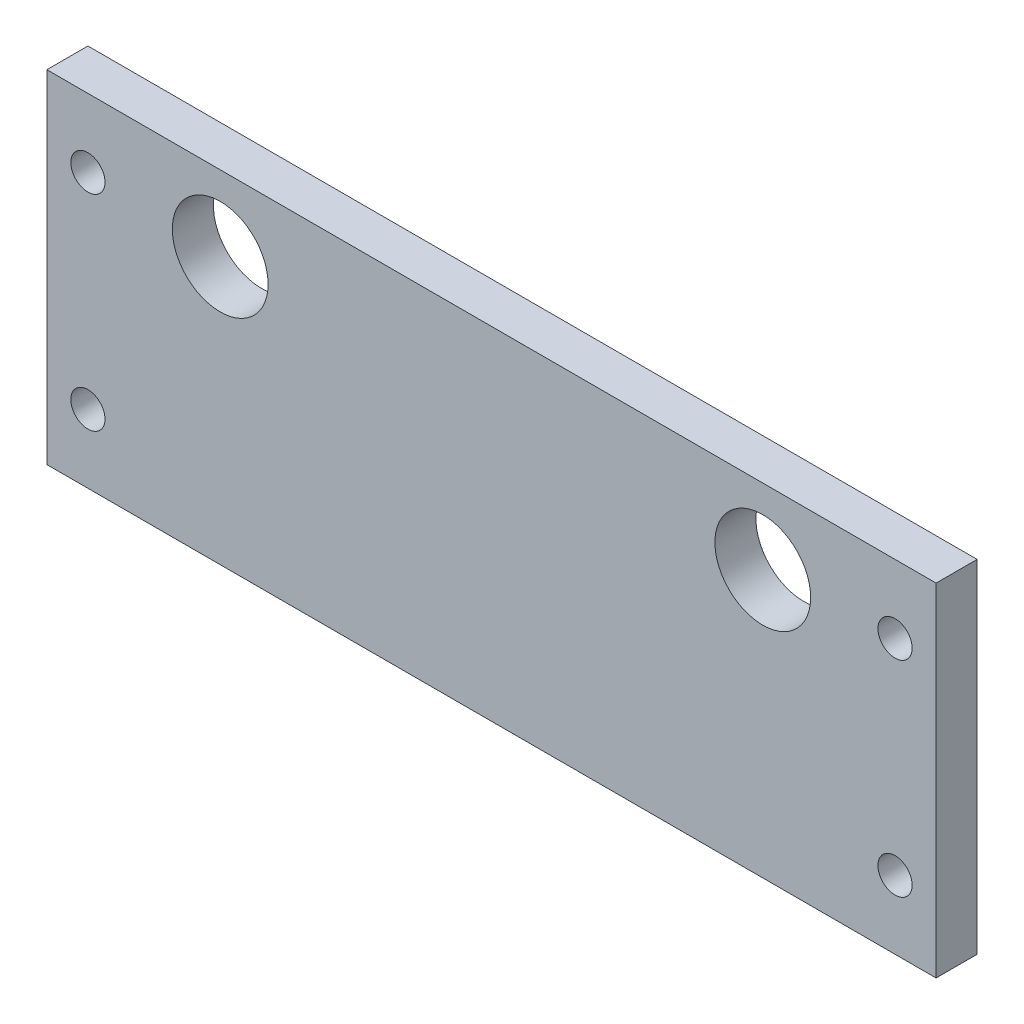
ISO-10303-21;
HEADER;
FILE_DESCRIPTION(('STEP AP214'),'2;1');
FILE_NAME('part.step','',(''),(''),'','','');
FILE_SCHEMA(('AUTOMOTIVE_DESIGN { 1 0 10303 214 1 1 1 1 }'));
ENDSEC;
DATA;
#1=APPLICATION_CONTEXT('core data for automotive mechanical design processes');
#2=APPLICATION_PROTOCOL_DEFINITION('international standard','automotive_design',2000,#1);
#3=PRODUCT_CONTEXT('',#1,'mechanical');
#4=PRODUCT('Part','Part','',(#3));
#5=PRODUCT_RELATED_PRODUCT_CATEGORY('part','',(#4));
#6=PRODUCT_DEFINITION_FORMATION('','',#4);
#7=PRODUCT_DEFINITION_CONTEXT('part definition',#1,'design');
#8=PRODUCT_DEFINITION('design','',#6,#7);
#9=PRODUCT_DEFINITION_SHAPE('','',#8);
#10=(LENGTH_UNIT() NAMED_UNIT(*) SI_UNIT(.MILLI.,.METRE.));
#11=(NAMED_UNIT(*) PLANE_ANGLE_UNIT() SI_UNIT($,.RADIAN.));
#12=(NAMED_UNIT(*) SI_UNIT($,.STERADIAN.) SOLID_ANGLE_UNIT());
#13=UNCERTAINTY_MEASURE_WITH_UNIT(LENGTH_MEASURE(1.E-05),#10,'distance_accuracy_value','');
#14=(GEOMETRIC_REPRESENTATION_CONTEXT(3) GLOBAL_UNCERTAINTY_ASSIGNED_CONTEXT((#13)) GLOBAL_UNIT_ASSIGNED_CONTEXT((#10,
#11,#12)) REPRESENTATION_CONTEXT('',''));
#15=CARTESIAN_POINT('',(0.,0.,0.));
#16=DIRECTION('',(0.,0.,1.));
#17=DIRECTION('',(1.,0.,0.));
#18=AXIS2_PLACEMENT_3D('',#15,#16,#17);
#19=CARTESIAN_POINT('',(32.5,0.,3.));
#20=DIRECTION('',(1.,0.,0.));
#21=DIRECTION('',(0.,0.,-1.));
#22=AXIS2_PLACEMENT_3D('',#19,#20,#21);
#23=PLANE('',#22);
#24=DIRECTION('',(0.,-1.,0.));
#25=VECTOR('',#24,1.);
#26=CARTESIAN_POINT('',(32.5,0.,0.));
#27=LINE('',#26,#25);
#28=CARTESIAN_POINT('',(32.5,12.5,0.));
#29=VERTEX_POINT('',#28);
#30=CARTESIAN_POINT('',(32.5,-12.5,0.));
#31=VERTEX_POINT('',#30);
#32=EDGE_CURVE('E114',#29,#31,#27,.T.);
#33=ORIENTED_EDGE('',*,*,#32,.F.);
#34=DIRECTION('',(0.,0.,-1.));
#35=VECTOR('',#34,1.);
#36=CARTESIAN_POINT('',(32.5,12.5,3.));
#37=LINE('',#36,#35);
#38=CARTESIAN_POINT('',(32.5,12.5,3.));
#39=VERTEX_POINT('',#38);
#40=EDGE_CURVE('E11',#39,#29,#37,.T.);
#41=ORIENTED_EDGE('',*,*,#40,.F.);
#42=DIRECTION('',(0.,-1.,0.));
#43=VECTOR('',#42,1.);
#44=CARTESIAN_POINT('',(32.5,0.,3.));
#45=LINE('',#44,#43);
#46=CARTESIAN_POINT('',(32.5,-12.5,3.));
#47=VERTEX_POINT('',#46);
#48=EDGE_CURVE('E100',#39,#47,#45,.T.);
#49=ORIENTED_EDGE('',*,*,#48,.T.);
#50=DIRECTION('',(0.,0.,-1.));
#51=VECTOR('',#50,1.);
#52=CARTESIAN_POINT('',(32.5,-12.5,3.));
#53=LINE('',#52,#51);
#54=EDGE_CURVE('E78',#47,#31,#53,.T.);
#55=ORIENTED_EDGE('',*,*,#54,.T.);
#56=EDGE_LOOP('',(#33,#41,#49,#55));
#57=FACE_BOUND('',#56,.T.);
#58=ADVANCED_FACE('F37',(#57),#23,.T.);
#59=CARTESIAN_POINT('',(0.,12.5,3.));
#60=DIRECTION('',(0.,1.,0.));
#61=DIRECTION('',(0.,0.,1.));
#62=AXIS2_PLACEMENT_3D('',#59,#60,#61);
#63=PLANE('',#62);
#64=DIRECTION('',(1.,0.,0.));
#65=VECTOR('',#64,1.);
#66=CARTESIAN_POINT('',(0.,12.5,0.));
#67=LINE('',#66,#65);
#68=CARTESIAN_POINT('',(-32.5,12.5,0.));
#69=VERTEX_POINT('',#68);
#70=EDGE_CURVE('E90',#69,#29,#67,.T.);
#71=ORIENTED_EDGE('',*,*,#70,.F.);
#72=DIRECTION('',(0.,0.,-1.));
#73=VECTOR('',#72,1.);
#74=CARTESIAN_POINT('',(-32.5,12.5,3.));
#75=LINE('',#74,#73);
#76=CARTESIAN_POINT('',(-32.5,12.5,3.));
#77=VERTEX_POINT('',#76);
#78=EDGE_CURVE('E47',#77,#69,#75,.T.);
#79=ORIENTED_EDGE('',*,*,#78,.F.);
#80=DIRECTION('',(1.,0.,0.));
#81=VECTOR('',#80,1.);
#82=CARTESIAN_POINT('',(0.,12.5,3.));
#83=LINE('',#82,#81);
#84=EDGE_CURVE('E88',#77,#39,#83,.T.);
#85=ORIENTED_EDGE('',*,*,#84,.T.);
#86=ORIENTED_EDGE('',*,*,#40,.T.);
#87=EDGE_LOOP('',(#71,#79,#85,#86));
#88=FACE_BOUND('',#87,.T.);
#89=ADVANCED_FACE('F86',(#88),#63,.T.);
#90=CARTESIAN_POINT('',(-32.5,0.,3.));
#91=DIRECTION('',(1.,0.,0.));
#92=DIRECTION('',(0.,0.,-1.));
#93=AXIS2_PLACEMENT_3D('',#90,#91,#92);
#94=PLANE('',#93);
#95=DIRECTION('',(0.,-1.,0.));
#96=VECTOR('',#95,1.);
#97=CARTESIAN_POINT('',(-32.5,0.,0.));
#98=LINE('',#97,#96);
#99=CARTESIAN_POINT('',(-32.5,-12.5,0.));
#100=VERTEX_POINT('',#99);
#101=EDGE_CURVE('E117',#69,#100,#98,.T.);
#102=ORIENTED_EDGE('',*,*,#101,.T.);
#103=DIRECTION('',(0.,0.,-1.));
#104=VECTOR('',#103,1.);
#105=CARTESIAN_POINT('',(-32.5,-12.5,3.));
#106=LINE('',#105,#104);
#107=CARTESIAN_POINT('',(-32.5,-12.5,3.));
#108=VERTEX_POINT('',#107);
#109=EDGE_CURVE('E93',#108,#100,#106,.T.);
#110=ORIENTED_EDGE('',*,*,#109,.F.);
#111=DIRECTION('',(0.,-1.,0.));
#112=VECTOR('',#111,1.);
#113=CARTESIAN_POINT('',(-32.5,0.,3.));
#114=LINE('',#113,#112);
#115=EDGE_CURVE('E96',#77,#108,#114,.T.);
#116=ORIENTED_EDGE('',*,*,#115,.F.);
#117=ORIENTED_EDGE('',*,*,#78,.T.);
#118=EDGE_LOOP('',(#102,#110,#116,#117));
#119=FACE_BOUND('',#118,.T.);
#120=ADVANCED_FACE('F97',(#119),#94,.F.);
#121=CARTESIAN_POINT('',(-19.83,7.,3.));
#122=DIRECTION('',(0.,0.,-1.));
#123=DIRECTION('',(-1.,0.,0.));
#124=AXIS2_PLACEMENT_3D('',#121,#122,#123);
#125=CYLINDRICAL_SURFACE('',#124,3.50000000000002);
#126=CARTESIAN_POINT('',(-19.83,7.,3.));
#127=DIRECTION('',(0.,0.,1.));
#128=DIRECTION('',(1.,0.,0.));
#129=AXIS2_PLACEMENT_3D('',#126,#127,#128);
#130=CIRCLE('',#129,3.50000000000002);
#131=CARTESIAN_POINT('',(-16.33,7.,3.));
#132=VERTEX_POINT('',#131);
#133=EDGE_CURVE('E102',#132,#132,#130,.T.);
#134=ORIENTED_EDGE('',*,*,#133,.T.);
#135=EDGE_LOOP('',(#134));
#136=FACE_BOUND('',#135,.T.);
#137=CARTESIAN_POINT('',(-19.83,7.,0.));
#138=DIRECTION('',(0.,0.,1.));
#139=DIRECTION('',(1.,0.,0.));
#140=AXIS2_PLACEMENT_3D('',#137,#138,#139);
#141=CIRCLE('',#140,3.50000000000002);
#142=CARTESIAN_POINT('',(-16.33,7.,0.));
#143=VERTEX_POINT('',#142);
#144=EDGE_CURVE('E110',#143,#143,#141,.T.);
#145=ORIENTED_EDGE('',*,*,#144,.F.);
#146=EDGE_LOOP('',(#145));
#147=FACE_BOUND('',#146,.T.);
#148=ADVANCED_FACE('F132',(#136,#147),#125,.F.);
#149=CARTESIAN_POINT('',(19.83,7.,3.));
#150=DIRECTION('',(0.,0.,-1.));
#151=DIRECTION('',(-1.,0.,0.));
#152=AXIS2_PLACEMENT_3D('',#149,#150,#151);
#153=CYLINDRICAL_SURFACE('',#152,3.50000000000002);
#154=CARTESIAN_POINT('',(19.83,7.,3.));
#155=DIRECTION('',(0.,0.,1.));
#156=DIRECTION('',(1.,0.,0.));
#157=AXIS2_PLACEMENT_3D('',#154,#155,#156);
#158=CIRCLE('',#157,3.50000000000002);
#159=CARTESIAN_POINT('',(23.33,7.,3.));
#160=VERTEX_POINT('',#159);
#161=EDGE_CURVE('E120',#160,#160,#158,.T.);
#162=ORIENTED_EDGE('',*,*,#161,.T.);
#163=EDGE_LOOP('',(#162));
#164=FACE_BOUND('',#163,.T.);
#165=CARTESIAN_POINT('',(19.83,7.,0.));
#166=DIRECTION('',(0.,0.,1.));
#167=DIRECTION('',(1.,0.,0.));
#168=AXIS2_PLACEMENT_3D('',#165,#166,#167);
#169=CIRCLE('',#168,3.50000000000002);
#170=CARTESIAN_POINT('',(23.33,7.,0.));
#171=VERTEX_POINT('',#170);
#172=EDGE_CURVE('E107',#171,#171,#169,.T.);
#173=ORIENTED_EDGE('',*,*,#172,.F.);
#174=EDGE_LOOP('',(#173));
#175=FACE_BOUND('',#174,.T.);
#176=ADVANCED_FACE('F39',(#164,#175),#153,.F.);
#177=CARTESIAN_POINT('',(0.,-12.5,3.));
#178=DIRECTION('',(0.,1.,0.));
#179=DIRECTION('',(-1.,0.,0.));
#180=AXIS2_PLACEMENT_3D('',#177,#178,#179);
#181=PLANE('',#180);
#182=DIRECTION('',(1.,0.,0.));
#183=VECTOR('',#182,1.);
#184=CARTESIAN_POINT('',(0.,-12.5,0.));
#185=LINE('',#184,#183);
#186=EDGE_CURVE('E71',#100,#31,#185,.T.);
#187=ORIENTED_EDGE('',*,*,#186,.T.);
#188=ORIENTED_EDGE('',*,*,#54,.F.);
#189=DIRECTION('',(1.,0.,0.));
#190=VECTOR('',#189,1.);
#191=CARTESIAN_POINT('',(0.,-12.5,3.));
#192=LINE('',#191,#190);
#193=EDGE_CURVE('E55',#108,#47,#192,.T.);
#194=ORIENTED_EDGE('',*,*,#193,.F.);
#195=ORIENTED_EDGE('',*,*,#109,.T.);
#196=EDGE_LOOP('',(#187,#188,#194,#195));
#197=FACE_BOUND('',#196,.T.);
#198=ADVANCED_FACE('F123',(#197),#181,.F.);
#199=CARTESIAN_POINT('',(0.,0.,3.));
#200=DIRECTION('',(0.,0.,1.));
#201=DIRECTION('',(1.,0.,0.));
#202=AXIS2_PLACEMENT_3D('',#199,#200,#201);
#203=PLANE('',#202);
#204=CARTESIAN_POINT('',(-29.5,7.5,3.));
#205=DIRECTION('',(0.,0.,1.));
#206=DIRECTION('',(1.,0.,0.));
#207=AXIS2_PLACEMENT_3D('',#204,#205,#206);
#208=CIRCLE('',#207,1.25);
#209=CARTESIAN_POINT('',(-28.25,7.5,3.));
#210=VERTEX_POINT('',#209);
#211=EDGE_CURVE('E224',#210,#210,#208,.T.);
#212=ORIENTED_EDGE('',*,*,#211,.F.);
#213=EDGE_LOOP('',(#212));
#214=FACE_BOUND('',#213,.T.);
#215=CARTESIAN_POINT('',(-29.5,-7.5,3.));
#216=DIRECTION('',(0.,0.,1.));
#217=DIRECTION('',(1.,0.,0.));
#218=AXIS2_PLACEMENT_3D('',#215,#216,#217);
#219=CIRCLE('',#218,1.25);
#220=CARTESIAN_POINT('',(-28.25,-7.5,3.));
#221=VERTEX_POINT('',#220);
#222=EDGE_CURVE('E227',#221,#221,#219,.T.);
#223=ORIENTED_EDGE('',*,*,#222,.F.);
#224=EDGE_LOOP('',(#223));
#225=FACE_BOUND('',#224,.T.);
#226=CARTESIAN_POINT('',(29.5,7.5,3.));
#227=DIRECTION('',(0.,0.,1.));
#228=DIRECTION('',(1.,0.,0.));
#229=AXIS2_PLACEMENT_3D('',#226,#227,#228);
#230=CIRCLE('',#229,1.25);
#231=CARTESIAN_POINT('',(30.75,7.5,3.));
#232=VERTEX_POINT('',#231);
#233=EDGE_CURVE('E233',#232,#232,#230,.T.);
#234=ORIENTED_EDGE('',*,*,#233,.F.);
#235=EDGE_LOOP('',(#234));
#236=FACE_BOUND('',#235,.T.);
#237=CARTESIAN_POINT('',(29.5,-7.5,3.));
#238=DIRECTION('',(0.,0.,1.));
#239=DIRECTION('',(1.,0.,0.));
#240=AXIS2_PLACEMENT_3D('',#237,#238,#239);
#241=CIRCLE('',#240,1.25);
#242=CARTESIAN_POINT('',(30.75,-7.5,3.));
#243=VERTEX_POINT('',#242);
#244=EDGE_CURVE('E239',#243,#243,#241,.T.);
#245=ORIENTED_EDGE('',*,*,#244,.F.);
#246=EDGE_LOOP('',(#245));
#247=FACE_BOUND('',#246,.T.);
#248=ORIENTED_EDGE('',*,*,#161,.F.);
#249=EDGE_LOOP('',(#248));
#250=FACE_BOUND('',#249,.T.);
#251=ORIENTED_EDGE('',*,*,#133,.F.);
#252=EDGE_LOOP('',(#251));
#253=FACE_BOUND('',#252,.T.);
#254=ORIENTED_EDGE('',*,*,#48,.F.);
#255=ORIENTED_EDGE('',*,*,#84,.F.);
#256=ORIENTED_EDGE('',*,*,#115,.T.);
#257=ORIENTED_EDGE('',*,*,#193,.T.);
#258=EDGE_LOOP('',(#254,#255,#256,#257));
#259=FACE_BOUND('',#258,.T.);
#260=ADVANCED_FACE('F99',(#214,#225,#236,#247,#250,#253,#259),#203,.T.);
#261=CARTESIAN_POINT('',(0.,0.,0.));
#262=DIRECTION('',(0.,0.,1.));
#263=DIRECTION('',(1.,0.,0.));
#264=AXIS2_PLACEMENT_3D('',#261,#262,#263);
#265=PLANE('',#264);
#266=CARTESIAN_POINT('',(-29.5,7.5,0.));
#267=DIRECTION('',(0.,0.,1.));
#268=DIRECTION('',(1.,0.,0.));
#269=AXIS2_PLACEMENT_3D('',#266,#267,#268);
#270=CIRCLE('',#269,1.25);
#271=CARTESIAN_POINT('',(-28.25,7.5,0.));
#272=VERTEX_POINT('',#271);
#273=EDGE_CURVE('E226',#272,#272,#270,.T.);
#274=ORIENTED_EDGE('',*,*,#273,.T.);
#275=EDGE_LOOP('',(#274));
#276=FACE_BOUND('',#275,.T.);
#277=CARTESIAN_POINT('',(-29.5,-7.5,0.));
#278=DIRECTION('',(0.,0.,1.));
#279=DIRECTION('',(1.,0.,0.));
#280=AXIS2_PLACEMENT_3D('',#277,#278,#279);
#281=CIRCLE('',#280,1.25);
#282=CARTESIAN_POINT('',(-28.25,-7.5,0.));
#283=VERTEX_POINT('',#282);
#284=EDGE_CURVE('E41',#283,#283,#281,.T.);
#285=ORIENTED_EDGE('',*,*,#284,.T.);
#286=EDGE_LOOP('',(#285));
#287=FACE_BOUND('',#286,.T.);
#288=CARTESIAN_POINT('',(29.5,7.5,0.));
#289=DIRECTION('',(0.,0.,1.));
#290=DIRECTION('',(1.,0.,0.));
#291=AXIS2_PLACEMENT_3D('',#288,#289,#290);
#292=CIRCLE('',#291,1.25);
#293=CARTESIAN_POINT('',(30.75,7.5,0.));
#294=VERTEX_POINT('',#293);
#295=EDGE_CURVE('E236',#294,#294,#292,.T.);
#296=ORIENTED_EDGE('',*,*,#295,.T.);
#297=EDGE_LOOP('',(#296));
#298=FACE_BOUND('',#297,.T.);
#299=CARTESIAN_POINT('',(29.5,-7.5,0.));
#300=DIRECTION('',(0.,0.,1.));
#301=DIRECTION('',(1.,0.,0.));
#302=AXIS2_PLACEMENT_3D('',#299,#300,#301);
#303=CIRCLE('',#302,1.25);
#304=CARTESIAN_POINT('',(30.75,-7.5,0.));
#305=VERTEX_POINT('',#304);
#306=EDGE_CURVE('E111',#305,#305,#303,.T.);
#307=ORIENTED_EDGE('',*,*,#306,.T.);
#308=EDGE_LOOP('',(#307));
#309=FACE_BOUND('',#308,.T.);
#310=ORIENTED_EDGE('',*,*,#172,.T.);
#311=EDGE_LOOP('',(#310));
#312=FACE_BOUND('',#311,.T.);
#313=ORIENTED_EDGE('',*,*,#144,.T.);
#314=EDGE_LOOP('',(#313));
#315=FACE_BOUND('',#314,.T.);
#316=ORIENTED_EDGE('',*,*,#32,.T.);
#317=ORIENTED_EDGE('',*,*,#186,.F.);
#318=ORIENTED_EDGE('',*,*,#101,.F.);
#319=ORIENTED_EDGE('',*,*,#70,.T.);
#320=EDGE_LOOP('',(#316,#317,#318,#319));
#321=FACE_BOUND('',#320,.T.);
#322=ADVANCED_FACE('F124',(#276,#287,#298,#309,#312,#315,#321),#265,.F.);
#323=CARTESIAN_POINT('',(29.5,-7.5,3.));
#324=DIRECTION('',(0.,0.,1.));
#325=DIRECTION('',(1.,0.,0.));
#326=AXIS2_PLACEMENT_3D('',#323,#324,#325);
#327=CYLINDRICAL_SURFACE('',#326,1.25);
#328=ORIENTED_EDGE('',*,*,#244,.T.);
#329=EDGE_LOOP('',(#328));
#330=FACE_BOUND('',#329,.T.);
#331=ORIENTED_EDGE('',*,*,#306,.F.);
#332=EDGE_LOOP('',(#331));
#333=FACE_BOUND('',#332,.T.);
#334=ADVANCED_FACE('F146',(#330,#333),#327,.F.);
#335=CARTESIAN_POINT('',(29.5,7.5,3.));
#336=DIRECTION('',(0.,0.,1.));
#337=DIRECTION('',(1.,0.,0.));
#338=AXIS2_PLACEMENT_3D('',#335,#336,#337);
#339=CYLINDRICAL_SURFACE('',#338,1.25);
#340=ORIENTED_EDGE('',*,*,#233,.T.);
#341=EDGE_LOOP('',(#340));
#342=FACE_BOUND('',#341,.T.);
#343=ORIENTED_EDGE('',*,*,#295,.F.);
#344=EDGE_LOOP('',(#343));
#345=FACE_BOUND('',#344,.T.);
#346=ADVANCED_FACE('F153',(#342,#345),#339,.F.);
#347=CARTESIAN_POINT('',(-29.5,-7.5,3.));
#348=DIRECTION('',(0.,0.,1.));
#349=DIRECTION('',(1.,0.,0.));
#350=AXIS2_PLACEMENT_3D('',#347,#348,#349);
#351=CYLINDRICAL_SURFACE('',#350,1.25);
#352=ORIENTED_EDGE('',*,*,#222,.T.);
#353=EDGE_LOOP('',(#352));
#354=FACE_BOUND('',#353,.T.);
#355=ORIENTED_EDGE('',*,*,#284,.F.);
#356=EDGE_LOOP('',(#355));
#357=FACE_BOUND('',#356,.T.);
#358=ADVANCED_FACE('F191',(#354,#357),#351,.F.);
#359=CARTESIAN_POINT('',(-29.5,7.5,3.));
#360=DIRECTION('',(0.,0.,1.));
#361=DIRECTION('',(1.,0.,0.));
#362=AXIS2_PLACEMENT_3D('',#359,#360,#361);
#363=CYLINDRICAL_SURFACE('',#362,1.25);
#364=ORIENTED_EDGE('',*,*,#211,.T.);
#365=EDGE_LOOP('',(#364));
#366=FACE_BOUND('',#365,.T.);
#367=ORIENTED_EDGE('',*,*,#273,.F.);
#368=EDGE_LOOP('',(#367));
#369=FACE_BOUND('',#368,.T.);
#370=ADVANCED_FACE('F202',(#366,#369),#363,.F.);
#371=CLOSED_SHELL('',(#58,#89,#120,#148,#176,#198,#260,#322,#334,#346,#358,#370));
#372=MANIFOLD_SOLID_BREP('B2',#371);
#373=ADVANCED_BREP_SHAPE_REPRESENTATION('',(#18,#372),#14);
#374=SHAPE_DEFINITION_REPRESENTATION(#9,#373);
ENDSEC;
END-ISO-10303-21;
